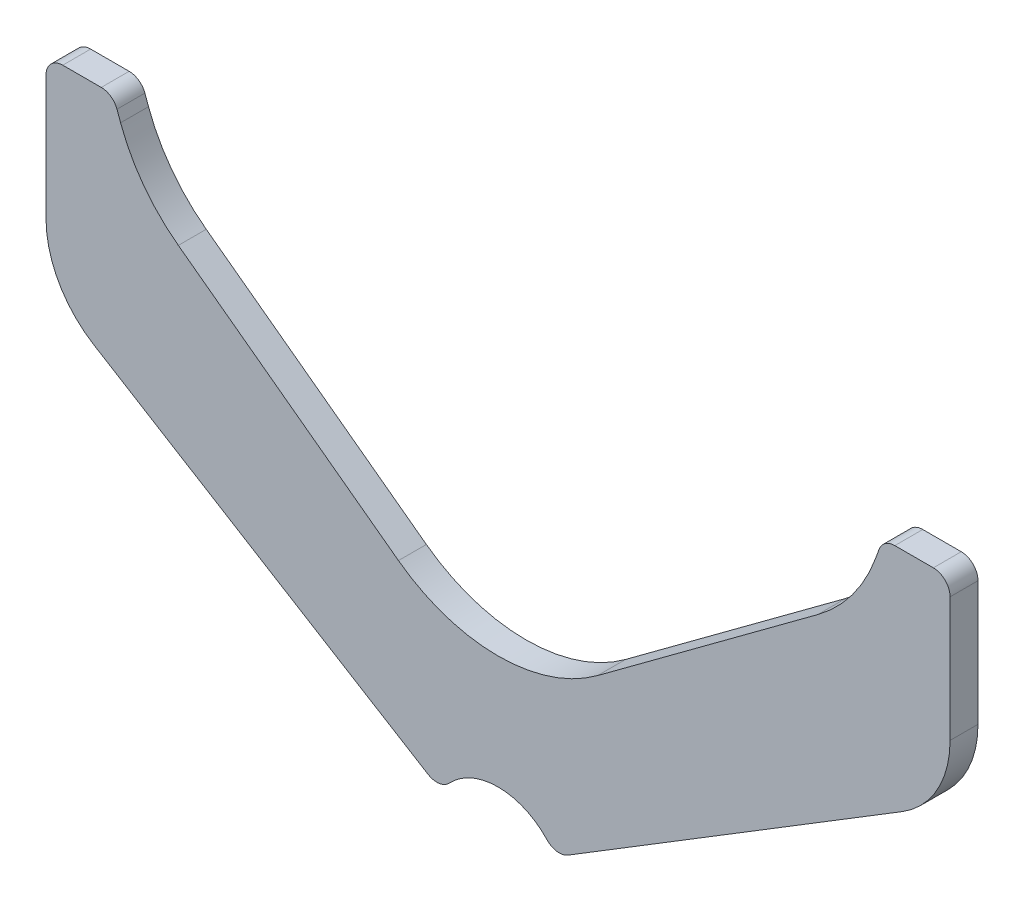
ISO-10303-21;
HEADER;
FILE_DESCRIPTION(('STEP AP214'),'2;1');
FILE_NAME('part.step','',(''),(''),'','','');
FILE_SCHEMA(('AUTOMOTIVE_DESIGN { 1 0 10303 214 1 1 1 1 }'));
ENDSEC;
DATA;
#1=APPLICATION_CONTEXT('core data for automotive mechanical design processes');
#2=APPLICATION_PROTOCOL_DEFINITION('international standard','automotive_design',2000,#1);
#3=PRODUCT_CONTEXT('',#1,'mechanical');
#4=PRODUCT('Part','Part','',(#3));
#5=PRODUCT_RELATED_PRODUCT_CATEGORY('part','',(#4));
#6=PRODUCT_DEFINITION_FORMATION('','',#4);
#7=PRODUCT_DEFINITION_CONTEXT('part definition',#1,'design');
#8=PRODUCT_DEFINITION('design','',#6,#7);
#9=PRODUCT_DEFINITION_SHAPE('','',#8);
#10=(LENGTH_UNIT() NAMED_UNIT(*) SI_UNIT(.MILLI.,.METRE.));
#11=(NAMED_UNIT(*) PLANE_ANGLE_UNIT() SI_UNIT($,.RADIAN.));
#12=(NAMED_UNIT(*) SI_UNIT($,.STERADIAN.) SOLID_ANGLE_UNIT());
#13=UNCERTAINTY_MEASURE_WITH_UNIT(LENGTH_MEASURE(1.E-05),#10,'distance_accuracy_value','');
#14=(GEOMETRIC_REPRESENTATION_CONTEXT(3) GLOBAL_UNCERTAINTY_ASSIGNED_CONTEXT((#13)) GLOBAL_UNIT_ASSIGNED_CONTEXT((#10,
#11,#12)) REPRESENTATION_CONTEXT('',''));
#15=CARTESIAN_POINT('',(0.,0.,0.));
#16=DIRECTION('',(0.,0.,1.));
#17=DIRECTION('',(1.,0.,0.));
#18=AXIS2_PLACEMENT_3D('',#15,#16,#17);
#19=CARTESIAN_POINT('',(-71.1006226146291,82.,5.));
#20=DIRECTION('',(0.,0.,-1.));
#21=DIRECTION('',(-1.,0.,0.));
#22=AXIS2_PLACEMENT_3D('',#19,#20,#21);
#23=CYLINDRICAL_SURFACE('',#22,3.);
#24=CARTESIAN_POINT('',(-71.1006226146291,82.,0.));
#25=DIRECTION('',(0.,0.,1.));
#26=DIRECTION('',(-1.,0.,0.));
#27=AXIS2_PLACEMENT_3D('',#24,#25,#26);
#28=CIRCLE('',#27,3.);
#29=CARTESIAN_POINT('',(-68.2815447522714,83.026060429977,0.));
#30=VERTEX_POINT('',#29);
#31=CARTESIAN_POINT('',(-71.1006226146291,85.,0.));
#32=VERTEX_POINT('',#31);
#33=EDGE_CURVE('E219',#30,#32,#28,.T.);
#34=ORIENTED_EDGE('',*,*,#33,.T.);
#35=DIRECTION('',(0.,0.,-1.));
#36=VECTOR('',#35,1.);
#37=CARTESIAN_POINT('',(-71.1006226146291,85.,5.));
#38=LINE('',#37,#36);
#39=CARTESIAN_POINT('',(-71.1006226146291,85.,5.));
#40=VERTEX_POINT('',#39);
#41=EDGE_CURVE('E11',#40,#32,#38,.T.);
#42=ORIENTED_EDGE('',*,*,#41,.F.);
#43=CARTESIAN_POINT('',(-71.1006226146291,82.,5.));
#44=DIRECTION('',(0.,0.,1.));
#45=DIRECTION('',(-1.,0.,0.));
#46=AXIS2_PLACEMENT_3D('',#43,#44,#45);
#47=CIRCLE('',#46,3.);
#48=CARTESIAN_POINT('',(-68.2815447522714,83.026060429977,5.));
#49=VERTEX_POINT('',#48);
#50=EDGE_CURVE('E261',#49,#40,#47,.T.);
#51=ORIENTED_EDGE('',*,*,#50,.F.);
#52=DIRECTION('',(0.,0.,-1.));
#53=VECTOR('',#52,1.);
#54=CARTESIAN_POINT('',(-68.2815447522714,83.026060429977,5.));
#55=LINE('',#54,#53);
#56=EDGE_CURVE('E215',#49,#30,#55,.T.);
#57=ORIENTED_EDGE('',*,*,#56,.T.);
#58=EDGE_LOOP('',(#34,#42,#51,#57));
#59=FACE_BOUND('',#58,.T.);
#60=ADVANCED_FACE('F39',(#59),#23,.T.);
#61=CARTESIAN_POINT('',(-71.1006226146291,85.,5.));
#62=DIRECTION('',(0.,-1.,0.));
#63=DIRECTION('',(0.,0.,-1.));
#64=AXIS2_PLACEMENT_3D('',#61,#62,#63);
#65=PLANE('',#64);
#66=DIRECTION('',(-1.,0.,0.));
#67=VECTOR('',#66,1.);
#68=CARTESIAN_POINT('',(-71.1006226146291,85.,0.));
#69=LINE('',#68,#67);
#70=CARTESIAN_POINT('',(-78.,85.,0.));
#71=VERTEX_POINT('',#70);
#72=EDGE_CURVE('E222',#32,#71,#69,.T.);
#73=ORIENTED_EDGE('',*,*,#72,.T.);
#74=DIRECTION('',(0.,0.,-1.));
#75=VECTOR('',#74,1.);
#76=CARTESIAN_POINT('',(-78.,85.,5.));
#77=LINE('',#76,#75);
#78=CARTESIAN_POINT('',(-78.,85.,5.));
#79=VERTEX_POINT('',#78);
#80=EDGE_CURVE('E47',#79,#71,#77,.T.);
#81=ORIENTED_EDGE('',*,*,#80,.F.);
#82=DIRECTION('',(-1.,0.,0.));
#83=VECTOR('',#82,1.);
#84=CARTESIAN_POINT('',(-71.1006226146291,85.,5.));
#85=LINE('',#84,#83);
#86=EDGE_CURVE('E140',#40,#79,#85,.T.);
#87=ORIENTED_EDGE('',*,*,#86,.F.);
#88=ORIENTED_EDGE('',*,*,#41,.T.);
#89=EDGE_LOOP('',(#73,#81,#87,#88));
#90=FACE_BOUND('',#89,.T.);
#91=ADVANCED_FACE('F389',(#90),#65,.F.);
#92=CARTESIAN_POINT('',(-78.,82.,5.));
#93=DIRECTION('',(0.,0.,-1.));
#94=DIRECTION('',(-1.,0.,0.));
#95=AXIS2_PLACEMENT_3D('',#92,#93,#94);
#96=CYLINDRICAL_SURFACE('',#95,3.);
#97=CARTESIAN_POINT('',(-78.,82.,0.));
#98=DIRECTION('',(0.,0.,1.));
#99=DIRECTION('',(-1.,0.,0.));
#100=AXIS2_PLACEMENT_3D('',#97,#98,#99);
#101=CIRCLE('',#100,3.);
#102=CARTESIAN_POINT('',(-81.,82.,0.));
#103=VERTEX_POINT('',#102);
#104=EDGE_CURVE('E224',#71,#103,#101,.T.);
#105=ORIENTED_EDGE('',*,*,#104,.T.);
#106=DIRECTION('',(0.,0.,-1.));
#107=VECTOR('',#106,1.);
#108=CARTESIAN_POINT('',(-81.,82.,5.));
#109=LINE('',#108,#107);
#110=CARTESIAN_POINT('',(-81.,82.,5.));
#111=VERTEX_POINT('',#110);
#112=EDGE_CURVE('E310',#111,#103,#109,.T.);
#113=ORIENTED_EDGE('',*,*,#112,.F.);
#114=CARTESIAN_POINT('',(-78.,82.,5.));
#115=DIRECTION('',(0.,0.,1.));
#116=DIRECTION('',(-1.,0.,0.));
#117=AXIS2_PLACEMENT_3D('',#114,#115,#116);
#118=CIRCLE('',#117,3.);
#119=EDGE_CURVE('E318',#79,#111,#118,.T.);
#120=ORIENTED_EDGE('',*,*,#119,.F.);
#121=ORIENTED_EDGE('',*,*,#80,.T.);
#122=EDGE_LOOP('',(#105,#113,#120,#121));
#123=FACE_BOUND('',#122,.T.);
#124=ADVANCED_FACE('F316',(#123),#96,.T.);
#125=CARTESIAN_POINT('',(-81.,82.,5.));
#126=DIRECTION('',(1.,0.,0.));
#127=DIRECTION('',(0.,0.,-1.));
#128=AXIS2_PLACEMENT_3D('',#125,#126,#127);
#129=PLANE('',#128);
#130=DIRECTION('',(0.,-1.,0.));
#131=VECTOR('',#130,1.);
#132=CARTESIAN_POINT('',(-81.,82.,0.));
#133=LINE('',#132,#131);
#134=CARTESIAN_POINT('',(-81.,59.7173481918676,0.));
#135=VERTEX_POINT('',#134);
#136=EDGE_CURVE('E226',#103,#135,#133,.T.);
#137=ORIENTED_EDGE('',*,*,#136,.T.);
#138=DIRECTION('',(0.,0.,-1.));
#139=VECTOR('',#138,1.);
#140=CARTESIAN_POINT('',(-81.,59.7173481918676,5.));
#141=LINE('',#140,#139);
#142=CARTESIAN_POINT('',(-81.,59.7173481918676,5.));
#143=VERTEX_POINT('',#142);
#144=EDGE_CURVE('E307',#143,#135,#141,.T.);
#145=ORIENTED_EDGE('',*,*,#144,.F.);
#146=DIRECTION('',(0.,-1.,0.));
#147=VECTOR('',#146,1.);
#148=CARTESIAN_POINT('',(-81.,82.,5.));
#149=LINE('',#148,#147);
#150=EDGE_CURVE('E336',#111,#143,#149,.T.);
#151=ORIENTED_EDGE('',*,*,#150,.F.);
#152=ORIENTED_EDGE('',*,*,#112,.T.);
#153=EDGE_LOOP('',(#137,#145,#151,#152));
#154=FACE_BOUND('',#153,.T.);
#155=ADVANCED_FACE('F327',(#154),#129,.F.);
#156=CARTESIAN_POINT('',(-63.,59.7173481918676,5.));
#157=DIRECTION('',(0.,0.,-1.));
#158=DIRECTION('',(-1.,0.,0.));
#159=AXIS2_PLACEMENT_3D('',#156,#157,#158);
#160=CYLINDRICAL_SURFACE('',#159,18.);
#161=CARTESIAN_POINT('',(-63.,59.7173481918676,0.));
#162=DIRECTION('',(0.,0.,1.));
#163=DIRECTION('',(-1.,0.,0.));
#164=AXIS2_PLACEMENT_3D('',#161,#162,#163);
#165=CIRCLE('',#164,18.);
#166=CARTESIAN_POINT('',(-72.404974164887,44.3698252334939,0.));
#167=VERTEX_POINT('',#166);
#168=EDGE_CURVE('E228',#135,#167,#165,.T.);
#169=ORIENTED_EDGE('',*,*,#168,.T.);
#170=DIRECTION('',(0.,0.,-1.));
#171=VECTOR('',#170,1.);
#172=CARTESIAN_POINT('',(-72.404974164887,44.3698252334939,5.));
#173=LINE('',#172,#171);
#174=CARTESIAN_POINT('',(-72.404974164887,44.3698252334939,5.));
#175=VERTEX_POINT('',#174);
#176=EDGE_CURVE('E304',#175,#167,#173,.T.);
#177=ORIENTED_EDGE('',*,*,#176,.F.);
#178=CARTESIAN_POINT('',(-63.,59.7173481918676,5.));
#179=DIRECTION('',(0.,0.,1.));
#180=DIRECTION('',(-1.,0.,0.));
#181=AXIS2_PLACEMENT_3D('',#178,#179,#180);
#182=CIRCLE('',#181,18.);
#183=EDGE_CURVE('E333',#143,#175,#182,.T.);
#184=ORIENTED_EDGE('',*,*,#183,.F.);
#185=ORIENTED_EDGE('',*,*,#144,.T.);
#186=EDGE_LOOP('',(#169,#177,#184,#185));
#187=FACE_BOUND('',#186,.T.);
#188=ADVANCED_FACE('F331',(#187),#160,.T.);
#189=CARTESIAN_POINT('',(-72.404974164887,44.3698252334939,5.));
#190=DIRECTION('',(0.522498564715947,0.852640164354094,0.));
#191=DIRECTION('',(-0.852640164354094,0.522498564715947,0.));
#192=AXIS2_PLACEMENT_3D('',#189,#190,#191);
#193=PLANE('',#192);
#194=DIRECTION('',(0.852640164354094,-0.522498564715947,0.));
#195=VECTOR('',#194,1.);
#196=CARTESIAN_POINT('',(-72.404974164887,44.3698252334939,0.));
#197=LINE('',#196,#195);
#198=CARTESIAN_POINT('',(-12.5312000212219,7.67912924934387,0.));
#199=VERTEX_POINT('',#198);
#200=EDGE_CURVE('E230',#167,#199,#197,.T.);
#201=ORIENTED_EDGE('',*,*,#200,.T.);
#202=DIRECTION('',(0.,0.,-1.));
#203=VECTOR('',#202,1.);
#204=CARTESIAN_POINT('',(-12.5312000212219,7.67912924934387,5.));
#205=LINE('',#204,#203);
#206=CARTESIAN_POINT('',(-12.5312000212219,7.67912924934387,5.));
#207=VERTEX_POINT('',#206);
#208=EDGE_CURVE('E301',#207,#199,#205,.T.);
#209=ORIENTED_EDGE('',*,*,#208,.F.);
#210=DIRECTION('',(0.852640164354094,-0.522498564715947,0.));
#211=VECTOR('',#210,1.);
#212=CARTESIAN_POINT('',(-72.404974164887,44.3698252334939,5.));
#213=LINE('',#212,#211);
#214=EDGE_CURVE('E335',#175,#207,#213,.T.);
#215=ORIENTED_EDGE('',*,*,#214,.F.);
#216=ORIENTED_EDGE('',*,*,#176,.T.);
#217=EDGE_LOOP('',(#201,#209,#215,#216));
#218=FACE_BOUND('',#217,.T.);
#219=ADVANCED_FACE('F402',(#218),#193,.F.);
#220=CARTESIAN_POINT('',(-10.963704327074,10.2370497424062,5.));
#221=DIRECTION('',(0.,0.,-1.));
#222=DIRECTION('',(-1.,0.,0.));
#223=AXIS2_PLACEMENT_3D('',#220,#221,#222);
#224=CYLINDRICAL_SURFACE('',#223,3.);
#225=CARTESIAN_POINT('',(-10.963704327074,10.2370497424062,0.));
#226=DIRECTION('',(0.,0.,1.));
#227=DIRECTION('',(1.,0.,0.));
#228=AXIS2_PLACEMENT_3D('',#225,#226,#227);
#229=CIRCLE('',#228,3.);
#230=CARTESIAN_POINT('',(-8.77096346165923,8.18963979392492,0.));
#231=VERTEX_POINT('',#230);
#232=EDGE_CURVE('E232',#199,#231,#229,.T.);
#233=ORIENTED_EDGE('',*,*,#232,.T.);
#234=DIRECTION('',(0.,0.,-1.));
#235=VECTOR('',#234,1.);
#236=CARTESIAN_POINT('',(-8.77096346165923,8.18963979392492,5.));
#237=LINE('',#236,#235);
#238=CARTESIAN_POINT('',(-8.77096346165923,8.18963979392492,5.));
#239=VERTEX_POINT('',#238);
#240=EDGE_CURVE('E298',#239,#231,#237,.T.);
#241=ORIENTED_EDGE('',*,*,#240,.F.);
#242=CARTESIAN_POINT('',(-10.963704327074,10.2370497424062,5.));
#243=DIRECTION('',(0.,0.,1.));
#244=DIRECTION('',(1.,0.,0.));
#245=AXIS2_PLACEMENT_3D('',#242,#243,#244);
#246=CIRCLE('',#245,3.);
#247=EDGE_CURVE('E338',#207,#239,#246,.T.);
#248=ORIENTED_EDGE('',*,*,#247,.F.);
#249=ORIENTED_EDGE('',*,*,#208,.T.);
#250=EDGE_LOOP('',(#233,#241,#248,#249));
#251=FACE_BOUND('',#250,.T.);
#252=ADVANCED_FACE('F405',(#251),#224,.T.);
#253=CARTESIAN_POINT('',(0.,0.,5.));
#254=DIRECTION('',(0.,0.,-1.));
#255=DIRECTION('',(-1.,0.,0.));
#256=AXIS2_PLACEMENT_3D('',#253,#254,#255);
#257=CYLINDRICAL_SURFACE('',#256,12.);
#258=CARTESIAN_POINT('',(0.,0.,0.));
#259=DIRECTION('',(0.,0.,-1.));
#260=DIRECTION('',(1.,0.,0.));
#261=AXIS2_PLACEMENT_3D('',#258,#259,#260);
#262=CIRCLE('',#261,12.);
#263=CARTESIAN_POINT('',(8.77096346165926,8.18963979392491,0.));
#264=VERTEX_POINT('',#263);
#265=EDGE_CURVE('E234',#231,#264,#262,.T.);
#266=ORIENTED_EDGE('',*,*,#265,.T.);
#267=DIRECTION('',(0.,0.,-1.));
#268=VECTOR('',#267,1.);
#269=CARTESIAN_POINT('',(8.77096346165926,8.18963979392491,5.));
#270=LINE('',#269,#268);
#271=CARTESIAN_POINT('',(8.77096346165926,8.18963979392491,5.));
#272=VERTEX_POINT('',#271);
#273=EDGE_CURVE('E295',#272,#264,#270,.T.);
#274=ORIENTED_EDGE('',*,*,#273,.F.);
#275=CARTESIAN_POINT('',(0.,0.,5.));
#276=DIRECTION('',(0.,0.,-1.));
#277=DIRECTION('',(1.,0.,0.));
#278=AXIS2_PLACEMENT_3D('',#275,#276,#277);
#279=CIRCLE('',#278,12.);
#280=EDGE_CURVE('E344',#239,#272,#279,.T.);
#281=ORIENTED_EDGE('',*,*,#280,.F.);
#282=ORIENTED_EDGE('',*,*,#240,.T.);
#283=EDGE_LOOP('',(#266,#274,#281,#282));
#284=FACE_BOUND('',#283,.T.);
#285=ADVANCED_FACE('F409',(#284),#257,.F.);
#286=CARTESIAN_POINT('',(10.9637043270741,10.2370497424062,5.));
#287=DIRECTION('',(0.,0.,-1.));
#288=DIRECTION('',(-1.,0.,0.));
#289=AXIS2_PLACEMENT_3D('',#286,#287,#288);
#290=CYLINDRICAL_SURFACE('',#289,3.);
#291=CARTESIAN_POINT('',(10.9637043270741,10.2370497424062,0.));
#292=DIRECTION('',(0.,0.,1.));
#293=DIRECTION('',(-1.,0.,0.));
#294=AXIS2_PLACEMENT_3D('',#291,#292,#293);
#295=CIRCLE('',#294,3.);
#296=CARTESIAN_POINT('',(12.5312000212219,7.67912924934388,0.));
#297=VERTEX_POINT('',#296);
#298=EDGE_CURVE('E236',#264,#297,#295,.T.);
#299=ORIENTED_EDGE('',*,*,#298,.T.);
#300=DIRECTION('',(0.,0.,-1.));
#301=VECTOR('',#300,1.);
#302=CARTESIAN_POINT('',(12.5312000212219,7.67912924934388,5.));
#303=LINE('',#302,#301);
#304=CARTESIAN_POINT('',(12.5312000212219,7.67912924934388,5.));
#305=VERTEX_POINT('',#304);
#306=EDGE_CURVE('E292',#305,#297,#303,.T.);
#307=ORIENTED_EDGE('',*,*,#306,.F.);
#308=CARTESIAN_POINT('',(10.9637043270741,10.2370497424062,5.));
#309=DIRECTION('',(0.,0.,1.));
#310=DIRECTION('',(-1.,0.,0.));
#311=AXIS2_PLACEMENT_3D('',#308,#309,#310);
#312=CIRCLE('',#311,3.);
#313=EDGE_CURVE('E346',#272,#305,#312,.T.);
#314=ORIENTED_EDGE('',*,*,#313,.F.);
#315=ORIENTED_EDGE('',*,*,#273,.T.);
#316=EDGE_LOOP('',(#299,#307,#314,#315));
#317=FACE_BOUND('',#316,.T.);
#318=ADVANCED_FACE('F413',(#317),#290,.T.);
#319=CARTESIAN_POINT('',(72.4049741648871,44.369825233494,5.));
#320=DIRECTION('',(-0.522498564715947,0.852640164354094,0.));
#321=DIRECTION('',(-0.852640164354094,-0.522498564715947,0.));
#322=AXIS2_PLACEMENT_3D('',#319,#320,#321);
#323=PLANE('',#322);
#324=DIRECTION('',(0.852640164354093,0.522498564715947,0.));
#325=VECTOR('',#324,1.);
#326=CARTESIAN_POINT('',(72.4049741648871,44.369825233494,0.));
#327=LINE('',#326,#325);
#328=CARTESIAN_POINT('',(72.4049741648871,44.369825233494,0.));
#329=VERTEX_POINT('',#328);
#330=EDGE_CURVE('E238',#297,#329,#327,.T.);
#331=ORIENTED_EDGE('',*,*,#330,.T.);
#332=DIRECTION('',(0.,0.,-1.));
#333=VECTOR('',#332,1.);
#334=CARTESIAN_POINT('',(72.4049741648871,44.369825233494,5.));
#335=LINE('',#334,#333);
#336=CARTESIAN_POINT('',(72.4049741648871,44.369825233494,5.));
#337=VERTEX_POINT('',#336);
#338=EDGE_CURVE('E289',#337,#329,#335,.T.);
#339=ORIENTED_EDGE('',*,*,#338,.F.);
#340=DIRECTION('',(0.852640164354093,0.522498564715947,0.));
#341=VECTOR('',#340,1.);
#342=CARTESIAN_POINT('',(72.4049741648871,44.369825233494,5.));
#343=LINE('',#342,#341);
#344=EDGE_CURVE('E348',#305,#337,#343,.T.);
#345=ORIENTED_EDGE('',*,*,#344,.F.);
#346=ORIENTED_EDGE('',*,*,#306,.T.);
#347=EDGE_LOOP('',(#331,#339,#345,#346));
#348=FACE_BOUND('',#347,.T.);
#349=ADVANCED_FACE('F417',(#348),#323,.F.);
#350=CARTESIAN_POINT('',(63.,59.7173481918676,5.));
#351=DIRECTION('',(0.,0.,-1.));
#352=DIRECTION('',(-1.,0.,0.));
#353=AXIS2_PLACEMENT_3D('',#350,#351,#352);
#354=CYLINDRICAL_SURFACE('',#353,18.);
#355=CARTESIAN_POINT('',(63.,59.7173481918676,0.));
#356=DIRECTION('',(0.,0.,1.));
#357=DIRECTION('',(-1.,0.,0.));
#358=AXIS2_PLACEMENT_3D('',#355,#356,#357);
#359=CIRCLE('',#358,18.);
#360=CARTESIAN_POINT('',(81.,59.7173481918676,0.));
#361=VERTEX_POINT('',#360);
#362=EDGE_CURVE('E240',#329,#361,#359,.T.);
#363=ORIENTED_EDGE('',*,*,#362,.T.);
#364=DIRECTION('',(0.,0.,-1.));
#365=VECTOR('',#364,1.);
#366=CARTESIAN_POINT('',(81.,59.7173481918676,5.));
#367=LINE('',#366,#365);
#368=CARTESIAN_POINT('',(81.,59.7173481918676,5.));
#369=VERTEX_POINT('',#368);
#370=EDGE_CURVE('E286',#369,#361,#367,.T.);
#371=ORIENTED_EDGE('',*,*,#370,.F.);
#372=CARTESIAN_POINT('',(63.,59.7173481918676,5.));
#373=DIRECTION('',(0.,0.,1.));
#374=DIRECTION('',(-1.,0.,0.));
#375=AXIS2_PLACEMENT_3D('',#372,#373,#374);
#376=CIRCLE('',#375,18.);
#377=EDGE_CURVE('E350',#337,#369,#376,.T.);
#378=ORIENTED_EDGE('',*,*,#377,.F.);
#379=ORIENTED_EDGE('',*,*,#338,.T.);
#380=EDGE_LOOP('',(#363,#371,#378,#379));
#381=FACE_BOUND('',#380,.T.);
#382=ADVANCED_FACE('F421',(#381),#354,.T.);
#383=CARTESIAN_POINT('',(81.,82.,5.));
#384=DIRECTION('',(-1.,0.,0.));
#385=DIRECTION('',(0.,0.,1.));
#386=AXIS2_PLACEMENT_3D('',#383,#384,#385);
#387=PLANE('',#386);
#388=DIRECTION('',(0.,1.,0.));
#389=VECTOR('',#388,1.);
#390=CARTESIAN_POINT('',(81.,82.,0.));
#391=LINE('',#390,#389);
#392=CARTESIAN_POINT('',(81.,82.,0.));
#393=VERTEX_POINT('',#392);
#394=EDGE_CURVE('E242',#361,#393,#391,.T.);
#395=ORIENTED_EDGE('',*,*,#394,.T.);
#396=DIRECTION('',(0.,0.,-1.));
#397=VECTOR('',#396,1.);
#398=CARTESIAN_POINT('',(81.,82.,5.));
#399=LINE('',#398,#397);
#400=CARTESIAN_POINT('',(81.,82.,5.));
#401=VERTEX_POINT('',#400);
#402=EDGE_CURVE('E283',#401,#393,#399,.T.);
#403=ORIENTED_EDGE('',*,*,#402,.F.);
#404=DIRECTION('',(0.,1.,0.));
#405=VECTOR('',#404,1.);
#406=CARTESIAN_POINT('',(81.,82.,5.));
#407=LINE('',#406,#405);
#408=EDGE_CURVE('E352',#369,#401,#407,.T.);
#409=ORIENTED_EDGE('',*,*,#408,.F.);
#410=ORIENTED_EDGE('',*,*,#370,.T.);
#411=EDGE_LOOP('',(#395,#403,#409,#410));
#412=FACE_BOUND('',#411,.T.);
#413=ADVANCED_FACE('F425',(#412),#387,.F.);
#414=CARTESIAN_POINT('',(78.,82.,5.));
#415=DIRECTION('',(0.,0.,-1.));
#416=DIRECTION('',(-1.,0.,0.));
#417=AXIS2_PLACEMENT_3D('',#414,#415,#416);
#418=CYLINDRICAL_SURFACE('',#417,3.);
#419=CARTESIAN_POINT('',(78.,82.,0.));
#420=DIRECTION('',(0.,0.,1.));
#421=DIRECTION('',(1.,0.,0.));
#422=AXIS2_PLACEMENT_3D('',#419,#420,#421);
#423=CIRCLE('',#422,3.);
#424=CARTESIAN_POINT('',(78.,85.,0.));
#425=VERTEX_POINT('',#424);
#426=EDGE_CURVE('E244',#393,#425,#423,.T.);
#427=ORIENTED_EDGE('',*,*,#426,.T.);
#428=DIRECTION('',(0.,0.,-1.));
#429=VECTOR('',#428,1.);
#430=CARTESIAN_POINT('',(78.,85.,5.));
#431=LINE('',#430,#429);
#432=CARTESIAN_POINT('',(78.,85.,5.));
#433=VERTEX_POINT('',#432);
#434=EDGE_CURVE('E280',#433,#425,#431,.T.);
#435=ORIENTED_EDGE('',*,*,#434,.F.);
#436=CARTESIAN_POINT('',(78.,82.,5.));
#437=DIRECTION('',(0.,0.,1.));
#438=DIRECTION('',(1.,0.,0.));
#439=AXIS2_PLACEMENT_3D('',#436,#437,#438);
#440=CIRCLE('',#439,3.);
#441=EDGE_CURVE('E354',#401,#433,#440,.T.);
#442=ORIENTED_EDGE('',*,*,#441,.F.);
#443=ORIENTED_EDGE('',*,*,#402,.T.);
#444=EDGE_LOOP('',(#427,#435,#442,#443));
#445=FACE_BOUND('',#444,.T.);
#446=ADVANCED_FACE('F429',(#445),#418,.T.);
#447=CARTESIAN_POINT('',(71.1006226146292,85.,5.));
#448=DIRECTION('',(0.,-1.,0.));
#449=DIRECTION('',(0.,0.,-1.));
#450=AXIS2_PLACEMENT_3D('',#447,#448,#449);
#451=PLANE('',#450);
#452=DIRECTION('',(-1.,0.,0.));
#453=VECTOR('',#452,1.);
#454=CARTESIAN_POINT('',(71.1006226146292,85.,0.));
#455=LINE('',#454,#453);
#456=CARTESIAN_POINT('',(71.1006226146292,85.,0.));
#457=VERTEX_POINT('',#456);
#458=EDGE_CURVE('E246',#425,#457,#455,.T.);
#459=ORIENTED_EDGE('',*,*,#458,.T.);
#460=DIRECTION('',(0.,0.,-1.));
#461=VECTOR('',#460,1.);
#462=CARTESIAN_POINT('',(71.1006226146292,85.,5.));
#463=LINE('',#462,#461);
#464=CARTESIAN_POINT('',(71.1006226146292,85.,5.));
#465=VERTEX_POINT('',#464);
#466=EDGE_CURVE('E277',#465,#457,#463,.T.);
#467=ORIENTED_EDGE('',*,*,#466,.F.);
#468=DIRECTION('',(-1.,0.,0.));
#469=VECTOR('',#468,1.);
#470=CARTESIAN_POINT('',(71.1006226146292,85.,5.));
#471=LINE('',#470,#469);
#472=EDGE_CURVE('E356',#433,#465,#471,.T.);
#473=ORIENTED_EDGE('',*,*,#472,.F.);
#474=ORIENTED_EDGE('',*,*,#434,.T.);
#475=EDGE_LOOP('',(#459,#467,#473,#474));
#476=FACE_BOUND('',#475,.T.);
#477=ADVANCED_FACE('F433',(#476),#451,.F.);
#478=CARTESIAN_POINT('',(71.1006226146292,82.,5.));
#479=DIRECTION('',(0.,0.,-1.));
#480=DIRECTION('',(-1.,0.,0.));
#481=AXIS2_PLACEMENT_3D('',#478,#479,#480);
#482=CYLINDRICAL_SURFACE('',#481,3.);
#483=CARTESIAN_POINT('',(71.1006226146292,82.,0.));
#484=DIRECTION('',(0.,0.,1.));
#485=DIRECTION('',(-1.,0.,0.));
#486=AXIS2_PLACEMENT_3D('',#483,#484,#485);
#487=CIRCLE('',#486,3.);
#488=CARTESIAN_POINT('',(68.2815447522714,83.026060429977,0.));
#489=VERTEX_POINT('',#488);
#490=EDGE_CURVE('E248',#457,#489,#487,.T.);
#491=ORIENTED_EDGE('',*,*,#490,.T.);
#492=DIRECTION('',(0.,0.,-1.));
#493=VECTOR('',#492,1.);
#494=CARTESIAN_POINT('',(68.2815447522714,83.026060429977,5.));
#495=LINE('',#494,#493);
#496=CARTESIAN_POINT('',(68.2815447522714,83.026060429977,5.));
#497=VERTEX_POINT('',#496);
#498=EDGE_CURVE('E274',#497,#489,#495,.T.);
#499=ORIENTED_EDGE('',*,*,#498,.F.);
#500=CARTESIAN_POINT('',(71.1006226146292,82.,5.));
#501=DIRECTION('',(0.,0.,1.));
#502=DIRECTION('',(-1.,0.,0.));
#503=AXIS2_PLACEMENT_3D('',#500,#501,#502);
#504=CIRCLE('',#503,3.);
#505=EDGE_CURVE('E358',#465,#497,#504,.T.);
#506=ORIENTED_EDGE('',*,*,#505,.F.);
#507=ORIENTED_EDGE('',*,*,#466,.T.);
#508=EDGE_LOOP('',(#491,#499,#506,#507));
#509=FACE_BOUND('',#508,.T.);
#510=ADVANCED_FACE('F437',(#509),#482,.T.);
#511=CARTESIAN_POINT('',(67.6334896320926,81.2455436207235,5.));
#512=DIRECTION('',(0.939692620785912,-0.34202014332566,0.));
#513=DIRECTION('',(0.34202014332566,0.939692620785912,0.));
#514=AXIS2_PLACEMENT_3D('',#511,#512,#513);
#515=PLANE('',#514);
#516=DIRECTION('',(-0.34202014332566,-0.939692620785912,0.));
#517=VECTOR('',#516,1.);
#518=CARTESIAN_POINT('',(67.6334896320926,81.2455436207235,0.));
#519=LINE('',#518,#517);
#520=CARTESIAN_POINT('',(67.6334896320926,81.2455436207235,0.));
#521=VERTEX_POINT('',#520);
#522=EDGE_CURVE('E250',#489,#521,#519,.T.);
#523=ORIENTED_EDGE('',*,*,#522,.T.);
#524=DIRECTION('',(0.,0.,-1.));
#525=VECTOR('',#524,1.);
#526=CARTESIAN_POINT('',(67.6334896320926,81.2455436207235,5.));
#527=LINE('',#526,#525);
#528=CARTESIAN_POINT('',(67.6334896320926,81.2455436207235,5.));
#529=VERTEX_POINT('',#528);
#530=EDGE_CURVE('E271',#529,#521,#527,.T.);
#531=ORIENTED_EDGE('',*,*,#530,.F.);
#532=DIRECTION('',(-0.34202014332566,-0.939692620785912,0.));
#533=VECTOR('',#532,1.);
#534=CARTESIAN_POINT('',(67.6334896320926,81.2455436207235,5.));
#535=LINE('',#534,#533);
#536=EDGE_CURVE('E360',#497,#529,#535,.T.);
#537=ORIENTED_EDGE('',*,*,#536,.F.);
#538=ORIENTED_EDGE('',*,*,#498,.T.);
#539=EDGE_LOOP('',(#523,#531,#537,#538));
#540=FACE_BOUND('',#539,.T.);
#541=ADVANCED_FACE('F441',(#540),#515,.F.);
#542=CARTESIAN_POINT('',(39.4427110085152,91.5061479204934,5.));
#543=DIRECTION('',(0.,0.,-1.));
#544=DIRECTION('',(-1.,0.,0.));
#545=AXIS2_PLACEMENT_3D('',#542,#543,#544);
#546=CYLINDRICAL_SURFACE('',#545,30.);
#547=CARTESIAN_POINT('',(39.4427110085152,91.5061479204934,0.));
#548=DIRECTION('',(0.,0.,-1.));
#549=DIRECTION('',(1.,0.,0.));
#550=AXIS2_PLACEMENT_3D('',#547,#548,#549);
#551=CIRCLE('',#550,30.);
#552=CARTESIAN_POINT('',(57.2873946110552,67.3904421019767,0.));
#553=VERTEX_POINT('',#552);
#554=EDGE_CURVE('E252',#521,#553,#551,.T.);
#555=ORIENTED_EDGE('',*,*,#554,.T.);
#556=DIRECTION('',(0.,0.,-1.));
#557=VECTOR('',#556,1.);
#558=CARTESIAN_POINT('',(57.2873946110552,67.3904421019767,5.));
#559=LINE('',#558,#557);
#560=CARTESIAN_POINT('',(57.2873946110552,67.3904421019767,5.));
#561=VERTEX_POINT('',#560);
#562=EDGE_CURVE('E268',#561,#553,#559,.T.);
#563=ORIENTED_EDGE('',*,*,#562,.F.);
#564=CARTESIAN_POINT('',(39.4427110085152,91.5061479204934,5.));
#565=DIRECTION('',(0.,0.,-1.));
#566=DIRECTION('',(1.,0.,0.));
#567=AXIS2_PLACEMENT_3D('',#564,#565,#566);
#568=CIRCLE('',#567,30.);
#569=EDGE_CURVE('E362',#529,#561,#568,.T.);
#570=ORIENTED_EDGE('',*,*,#569,.F.);
#571=ORIENTED_EDGE('',*,*,#530,.T.);
#572=EDGE_LOOP('',(#555,#563,#570,#571));
#573=FACE_BOUND('',#572,.T.);
#574=ADVANCED_FACE('F445',(#573),#546,.F.);
#575=CARTESIAN_POINT('',(17.84468360254,38.2043712620784,5.));
#576=DIRECTION('',(0.594822786751333,-0.803856860617224,0.));
#577=DIRECTION('',(0.803856860617224,0.594822786751333,0.));
#578=AXIS2_PLACEMENT_3D('',#575,#576,#577);
#579=PLANE('',#578);
#580=DIRECTION('',(-0.803856860617224,-0.594822786751333,0.));
#581=VECTOR('',#580,1.);
#582=CARTESIAN_POINT('',(17.84468360254,38.2043712620784,0.));
#583=LINE('',#582,#581);
#584=CARTESIAN_POINT('',(17.84468360254,38.2043712620784,0.));
#585=VERTEX_POINT('',#584);
#586=EDGE_CURVE('E254',#553,#585,#583,.T.);
#587=ORIENTED_EDGE('',*,*,#586,.T.);
#588=DIRECTION('',(0.,0.,-1.));
#589=VECTOR('',#588,1.);
#590=CARTESIAN_POINT('',(17.84468360254,38.2043712620784,5.));
#591=LINE('',#590,#589);
#592=CARTESIAN_POINT('',(17.84468360254,38.2043712620784,5.));
#593=VERTEX_POINT('',#592);
#594=EDGE_CURVE('E265',#593,#585,#591,.T.);
#595=ORIENTED_EDGE('',*,*,#594,.F.);
#596=DIRECTION('',(-0.803856860617224,-0.594822786751333,0.));
#597=VECTOR('',#596,1.);
#598=CARTESIAN_POINT('',(17.84468360254,38.2043712620784,5.));
#599=LINE('',#598,#597);
#600=EDGE_CURVE('E364',#561,#593,#599,.T.);
#601=ORIENTED_EDGE('',*,*,#600,.F.);
#602=ORIENTED_EDGE('',*,*,#562,.T.);
#603=EDGE_LOOP('',(#587,#595,#601,#602));
#604=FACE_BOUND('',#603,.T.);
#605=ADVANCED_FACE('F370',(#604),#579,.F.);
#606=CARTESIAN_POINT('',(0.,62.3200770805951,5.));
#607=DIRECTION('',(0.,0.,-1.));
#608=DIRECTION('',(-1.,0.,0.));
#609=AXIS2_PLACEMENT_3D('',#606,#607,#608);
#610=CYLINDRICAL_SURFACE('',#609,30.);
#611=CARTESIAN_POINT('',(0.,62.3200770805951,0.));
#612=DIRECTION('',(0.,0.,-1.));
#613=DIRECTION('',(-1.,0.,0.));
#614=AXIS2_PLACEMENT_3D('',#611,#612,#613);
#615=CIRCLE('',#614,30.);
#616=CARTESIAN_POINT('',(-17.84468360254,38.2043712620784,0.));
#617=VERTEX_POINT('',#616);
#618=EDGE_CURVE('E256',#585,#617,#615,.T.);
#619=ORIENTED_EDGE('',*,*,#618,.T.);
#620=DIRECTION('',(0.,0.,-1.));
#621=VECTOR('',#620,1.);
#622=CARTESIAN_POINT('',(-17.84468360254,38.2043712620784,5.));
#623=LINE('',#622,#621);
#624=CARTESIAN_POINT('',(-17.84468360254,38.2043712620784,5.));
#625=VERTEX_POINT('',#624);
#626=EDGE_CURVE('E210',#625,#617,#623,.T.);
#627=ORIENTED_EDGE('',*,*,#626,.F.);
#628=CARTESIAN_POINT('',(0.,62.3200770805951,5.));
#629=DIRECTION('',(0.,0.,-1.));
#630=DIRECTION('',(-1.,0.,0.));
#631=AXIS2_PLACEMENT_3D('',#628,#629,#630);
#632=CIRCLE('',#631,30.);
#633=EDGE_CURVE('E201',#593,#625,#632,.T.);
#634=ORIENTED_EDGE('',*,*,#633,.F.);
#635=ORIENTED_EDGE('',*,*,#594,.T.);
#636=EDGE_LOOP('',(#619,#627,#634,#635));
#637=FACE_BOUND('',#636,.T.);
#638=ADVANCED_FACE('F374',(#637),#610,.F.);
#639=CARTESIAN_POINT('',(-17.84468360254,38.2043712620784,5.));
#640=DIRECTION('',(-0.594822786751333,-0.803856860617224,0.));
#641=DIRECTION('',(0.803856860617224,-0.594822786751333,0.));
#642=AXIS2_PLACEMENT_3D('',#639,#640,#641);
#643=PLANE('',#642);
#644=DIRECTION('',(-0.803856860617224,0.594822786751333,0.));
#645=VECTOR('',#644,1.);
#646=CARTESIAN_POINT('',(-17.84468360254,38.2043712620784,0.));
#647=LINE('',#646,#645);
#648=CARTESIAN_POINT('',(-57.2873946110552,67.3904421019767,0.));
#649=VERTEX_POINT('',#648);
#650=EDGE_CURVE('E209',#617,#649,#647,.T.);
#651=ORIENTED_EDGE('',*,*,#650,.T.);
#652=DIRECTION('',(0.,0.,-1.));
#653=VECTOR('',#652,1.);
#654=CARTESIAN_POINT('',(-57.2873946110552,67.3904421019767,5.));
#655=LINE('',#654,#653);
#656=CARTESIAN_POINT('',(-57.2873946110552,67.3904421019767,5.));
#657=VERTEX_POINT('',#656);
#658=EDGE_CURVE('E206',#657,#649,#655,.T.);
#659=ORIENTED_EDGE('',*,*,#658,.F.);
#660=DIRECTION('',(-0.803856860617224,0.594822786751333,0.));
#661=VECTOR('',#660,1.);
#662=CARTESIAN_POINT('',(-17.84468360254,38.2043712620784,5.));
#663=LINE('',#662,#661);
#664=EDGE_CURVE('E195',#625,#657,#663,.T.);
#665=ORIENTED_EDGE('',*,*,#664,.F.);
#666=ORIENTED_EDGE('',*,*,#626,.T.);
#667=EDGE_LOOP('',(#651,#659,#665,#666));
#668=FACE_BOUND('',#667,.T.);
#669=ADVANCED_FACE('F207',(#668),#643,.F.);
#670=CARTESIAN_POINT('',(-39.4427110085152,91.5061479204934,5.));
#671=DIRECTION('',(0.,0.,-1.));
#672=DIRECTION('',(-1.,0.,0.));
#673=AXIS2_PLACEMENT_3D('',#670,#671,#672);
#674=CYLINDRICAL_SURFACE('',#673,30.);
#675=CARTESIAN_POINT('',(-39.4427110085152,91.5061479204934,0.));
#676=DIRECTION('',(0.,0.,-1.));
#677=DIRECTION('',(1.,0.,0.));
#678=AXIS2_PLACEMENT_3D('',#675,#676,#677);
#679=CIRCLE('',#678,30.);
#680=CARTESIAN_POINT('',(-67.6334896320925,81.2455436207235,0.));
#681=VERTEX_POINT('',#680);
#682=EDGE_CURVE('E126',#649,#681,#679,.T.);
#683=ORIENTED_EDGE('',*,*,#682,.T.);
#684=DIRECTION('',(0.,0.,-1.));
#685=VECTOR('',#684,1.);
#686=CARTESIAN_POINT('',(-67.6334896320925,81.2455436207235,5.));
#687=LINE('',#686,#685);
#688=CARTESIAN_POINT('',(-67.6334896320925,81.2455436207235,5.));
#689=VERTEX_POINT('',#688);
#690=EDGE_CURVE('E211',#689,#681,#687,.T.);
#691=ORIENTED_EDGE('',*,*,#690,.F.);
#692=CARTESIAN_POINT('',(-39.4427110085152,91.5061479204934,5.));
#693=DIRECTION('',(0.,0.,-1.));
#694=DIRECTION('',(1.,0.,0.));
#695=AXIS2_PLACEMENT_3D('',#692,#693,#694);
#696=CIRCLE('',#695,30.);
#697=EDGE_CURVE('E199',#657,#689,#696,.T.);
#698=ORIENTED_EDGE('',*,*,#697,.F.);
#699=ORIENTED_EDGE('',*,*,#658,.T.);
#700=EDGE_LOOP('',(#683,#691,#698,#699));
#701=FACE_BOUND('',#700,.T.);
#702=ADVANCED_FACE('F213',(#701),#674,.F.);
#703=CARTESIAN_POINT('',(-67.6334896320925,81.2455436207235,5.));
#704=DIRECTION('',(-0.939692620785911,-0.342020143325662,0.));
#705=DIRECTION('',(0.342020143325662,-0.939692620785911,0.));
#706=AXIS2_PLACEMENT_3D('',#703,#704,#705);
#707=PLANE('',#706);
#708=DIRECTION('',(-0.342020143325662,0.939692620785911,0.));
#709=VECTOR('',#708,1.);
#710=CARTESIAN_POINT('',(-67.6334896320925,81.2455436207235,0.));
#711=LINE('',#710,#709);
#712=EDGE_CURVE('E132',#681,#30,#711,.T.);
#713=ORIENTED_EDGE('',*,*,#712,.T.);
#714=ORIENTED_EDGE('',*,*,#56,.F.);
#715=DIRECTION('',(-0.342020143325662,0.939692620785911,0.));
#716=VECTOR('',#715,1.);
#717=CARTESIAN_POINT('',(-67.6334896320925,81.2455436207235,5.));
#718=LINE('',#717,#716);
#719=EDGE_CURVE('E55',#689,#49,#718,.T.);
#720=ORIENTED_EDGE('',*,*,#719,.F.);
#721=ORIENTED_EDGE('',*,*,#690,.T.);
#722=EDGE_LOOP('',(#713,#714,#720,#721));
#723=FACE_BOUND('',#722,.T.);
#724=ADVANCED_FACE('F378',(#723),#707,.F.);
#725=CARTESIAN_POINT('',(-71.1006226146291,82.,5.));
#726=DIRECTION('',(0.,0.,-1.));
#727=DIRECTION('',(-1.,0.,0.));
#728=AXIS2_PLACEMENT_3D('',#725,#726,#727);
#729=PLANE('',#728);
#730=ORIENTED_EDGE('',*,*,#50,.T.);
#731=ORIENTED_EDGE('',*,*,#86,.T.);
#732=ORIENTED_EDGE('',*,*,#119,.T.);
#733=ORIENTED_EDGE('',*,*,#150,.T.);
#734=ORIENTED_EDGE('',*,*,#183,.T.);
#735=ORIENTED_EDGE('',*,*,#214,.T.);
#736=ORIENTED_EDGE('',*,*,#247,.T.);
#737=ORIENTED_EDGE('',*,*,#280,.T.);
#738=ORIENTED_EDGE('',*,*,#313,.T.);
#739=ORIENTED_EDGE('',*,*,#344,.T.);
#740=ORIENTED_EDGE('',*,*,#377,.T.);
#741=ORIENTED_EDGE('',*,*,#408,.T.);
#742=ORIENTED_EDGE('',*,*,#441,.T.);
#743=ORIENTED_EDGE('',*,*,#472,.T.);
#744=ORIENTED_EDGE('',*,*,#505,.T.);
#745=ORIENTED_EDGE('',*,*,#536,.T.);
#746=ORIENTED_EDGE('',*,*,#569,.T.);
#747=ORIENTED_EDGE('',*,*,#600,.T.);
#748=ORIENTED_EDGE('',*,*,#633,.T.);
#749=ORIENTED_EDGE('',*,*,#664,.T.);
#750=ORIENTED_EDGE('',*,*,#697,.T.);
#751=ORIENTED_EDGE('',*,*,#719,.T.);
#752=EDGE_LOOP('',(#730,#731,#732,#733,#734,#735,#736,#737,#738,#739,#740,#741,#742,#743,#744,
#745,#746,#747,#748,#749,#750,#751));
#753=FACE_BOUND('',#752,.T.);
#754=ADVANCED_FACE('F197',(#753),#729,.F.);
#755=CARTESIAN_POINT('',(-71.1006226146291,82.,0.));
#756=DIRECTION('',(0.,0.,-1.));
#757=DIRECTION('',(-1.,0.,0.));
#758=AXIS2_PLACEMENT_3D('',#755,#756,#757);
#759=PLANE('',#758);
#760=ORIENTED_EDGE('',*,*,#33,.F.);
#761=ORIENTED_EDGE('',*,*,#712,.F.);
#762=ORIENTED_EDGE('',*,*,#682,.F.);
#763=ORIENTED_EDGE('',*,*,#650,.F.);
#764=ORIENTED_EDGE('',*,*,#618,.F.);
#765=ORIENTED_EDGE('',*,*,#586,.F.);
#766=ORIENTED_EDGE('',*,*,#554,.F.);
#767=ORIENTED_EDGE('',*,*,#522,.F.);
#768=ORIENTED_EDGE('',*,*,#490,.F.);
#769=ORIENTED_EDGE('',*,*,#458,.F.);
#770=ORIENTED_EDGE('',*,*,#426,.F.);
#771=ORIENTED_EDGE('',*,*,#394,.F.);
#772=ORIENTED_EDGE('',*,*,#362,.F.);
#773=ORIENTED_EDGE('',*,*,#330,.F.);
#774=ORIENTED_EDGE('',*,*,#298,.F.);
#775=ORIENTED_EDGE('',*,*,#265,.F.);
#776=ORIENTED_EDGE('',*,*,#232,.F.);
#777=ORIENTED_EDGE('',*,*,#200,.F.);
#778=ORIENTED_EDGE('',*,*,#168,.F.);
#779=ORIENTED_EDGE('',*,*,#136,.F.);
#780=ORIENTED_EDGE('',*,*,#104,.F.);
#781=ORIENTED_EDGE('',*,*,#72,.F.);
#782=EDGE_LOOP('',(#760,#761,#762,#763,#764,#765,#766,#767,#768,#769,#770,#771,#772,#773,#774,
#775,#776,#777,#778,#779,#780,#781));
#783=FACE_BOUND('',#782,.T.);
#784=ADVANCED_FACE('F322',(#783),#759,.T.);
#785=CLOSED_SHELL('',(#60,#91,#124,#155,#188,#219,#252,#285,#318,#349,#382,#413,#446,#477,#510,
#541,#574,#605,#638,#669,#702,#724,#754,#784));
#786=MANIFOLD_SOLID_BREP('B2',#785);
#787=ADVANCED_BREP_SHAPE_REPRESENTATION('',(#18,#786),#14);
#788=SHAPE_DEFINITION_REPRESENTATION(#9,#787);
ENDSEC;
END-ISO-10303-21;
